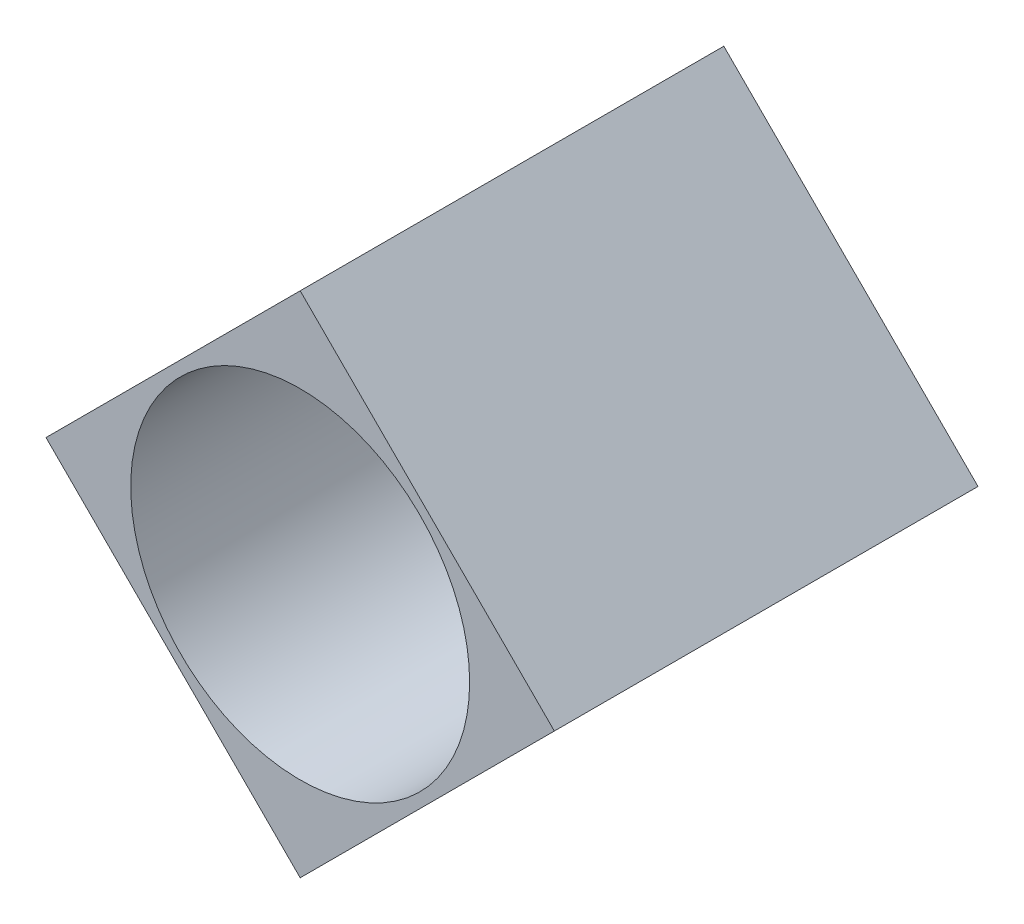
ISO-10303-21;
HEADER;
FILE_DESCRIPTION(('STEP AP214'),'2;1');
FILE_NAME('part.step','',(''),(''),'','','');
FILE_SCHEMA(('AUTOMOTIVE_DESIGN { 1 0 10303 214 1 1 1 1 }'));
ENDSEC;
DATA;
#1=APPLICATION_CONTEXT('core data for automotive mechanical design processes');
#2=APPLICATION_PROTOCOL_DEFINITION('international standard','automotive_design',2000,#1);
#3=PRODUCT_CONTEXT('',#1,'mechanical');
#4=PRODUCT('Part','Part','',(#3));
#5=PRODUCT_RELATED_PRODUCT_CATEGORY('part','',(#4));
#6=PRODUCT_DEFINITION_FORMATION('','',#4);
#7=PRODUCT_DEFINITION_CONTEXT('part definition',#1,'design');
#8=PRODUCT_DEFINITION('design','',#6,#7);
#9=PRODUCT_DEFINITION_SHAPE('','',#8);
#10=(LENGTH_UNIT() NAMED_UNIT(*) SI_UNIT(.MILLI.,.METRE.));
#11=(NAMED_UNIT(*) PLANE_ANGLE_UNIT() SI_UNIT($,.RADIAN.));
#12=(NAMED_UNIT(*) SI_UNIT($,.STERADIAN.) SOLID_ANGLE_UNIT());
#13=UNCERTAINTY_MEASURE_WITH_UNIT(LENGTH_MEASURE(1.E-05),#10,'distance_accuracy_value','');
#14=(GEOMETRIC_REPRESENTATION_CONTEXT(3) GLOBAL_UNCERTAINTY_ASSIGNED_CONTEXT((#13)) GLOBAL_UNIT_ASSIGNED_CONTEXT((#10,
#11,#12)) REPRESENTATION_CONTEXT('',''));
#15=CARTESIAN_POINT('',(0.,0.,0.));
#16=DIRECTION('',(0.,0.,1.));
#17=DIRECTION('',(1.,0.,0.));
#18=AXIS2_PLACEMENT_3D('',#15,#16,#17);
#19=CARTESIAN_POINT('',(0.,0.,5.));
#20=DIRECTION('',(0.,0.,-1.));
#21=DIRECTION('',(-1.,0.,0.));
#22=AXIS2_PLACEMENT_3D('',#19,#20,#21);
#23=PLANE('',#22);
#24=DIRECTION('',(-0.707106781186548,-0.707106781186548,0.));
#25=VECTOR('',#24,1.);
#26=CARTESIAN_POINT('',(-3.,0.,5.));
#27=LINE('',#26,#25);
#28=CARTESIAN_POINT('',(0.,3.,5.));
#29=VERTEX_POINT('',#28);
#30=CARTESIAN_POINT('',(-3.,0.,5.));
#31=VERTEX_POINT('',#30);
#32=EDGE_CURVE('E91',#29,#31,#27,.T.);
#33=ORIENTED_EDGE('',*,*,#32,.T.);
#34=DIRECTION('',(0.707106781186548,-0.707106781186548,0.));
#35=VECTOR('',#34,1.);
#36=CARTESIAN_POINT('',(0.,-3.,5.));
#37=LINE('',#36,#35);
#38=CARTESIAN_POINT('',(0.,-3.,5.));
#39=VERTEX_POINT('',#38);
#40=EDGE_CURVE('E86',#31,#39,#37,.T.);
#41=ORIENTED_EDGE('',*,*,#40,.T.);
#42=DIRECTION('',(0.707106781186548,0.707106781186548,0.));
#43=VECTOR('',#42,1.);
#44=CARTESIAN_POINT('',(3.,0.,5.));
#45=LINE('',#44,#43);
#46=CARTESIAN_POINT('',(3.,0.,5.));
#47=VERTEX_POINT('',#46);
#48=EDGE_CURVE('E89',#39,#47,#45,.T.);
#49=ORIENTED_EDGE('',*,*,#48,.T.);
#50=DIRECTION('',(-0.707106781186548,0.707106781186548,0.));
#51=VECTOR('',#50,1.);
#52=CARTESIAN_POINT('',(0.,3.,5.));
#53=LINE('',#52,#51);
#54=EDGE_CURVE('E56',#47,#29,#53,.T.);
#55=ORIENTED_EDGE('',*,*,#54,.T.);
#56=EDGE_LOOP('',(#33,#41,#49,#55));
#57=FACE_BOUND('',#56,.T.);
#58=CARTESIAN_POINT('',(0.,0.,5.));
#59=DIRECTION('',(0.,0.,1.));
#60=DIRECTION('',(1.,0.,0.));
#61=AXIS2_PLACEMENT_3D('',#58,#59,#60);
#62=CIRCLE('',#61,2.);
#63=CARTESIAN_POINT('',(2.,0.,5.));
#64=VERTEX_POINT('',#63);
#65=EDGE_CURVE('E106',#64,#64,#62,.T.);
#66=ORIENTED_EDGE('',*,*,#65,.F.);
#67=EDGE_LOOP('',(#66));
#68=FACE_BOUND('',#67,.T.);
#69=ADVANCED_FACE('F39',(#57,#68),#23,.F.);
#70=CARTESIAN_POINT('',(0.,0.,0.));
#71=DIRECTION('',(0.,0.,-1.));
#72=DIRECTION('',(-1.,0.,0.));
#73=AXIS2_PLACEMENT_3D('',#70,#71,#72);
#74=PLANE('',#73);
#75=DIRECTION('',(-0.707106781186548,-0.707106781186548,0.));
#76=VECTOR('',#75,1.);
#77=CARTESIAN_POINT('',(-3.,0.,0.));
#78=LINE('',#77,#76);
#79=CARTESIAN_POINT('',(0.,3.,0.));
#80=VERTEX_POINT('',#79);
#81=CARTESIAN_POINT('',(-3.,0.,0.));
#82=VERTEX_POINT('',#81);
#83=EDGE_CURVE('E103',#80,#82,#78,.T.);
#84=ORIENTED_EDGE('',*,*,#83,.F.);
#85=DIRECTION('',(-0.707106781186548,0.707106781186548,0.));
#86=VECTOR('',#85,1.);
#87=CARTESIAN_POINT('',(0.,3.,0.));
#88=LINE('',#87,#86);
#89=CARTESIAN_POINT('',(3.,0.,0.));
#90=VERTEX_POINT('',#89);
#91=EDGE_CURVE('E79',#90,#80,#88,.T.);
#92=ORIENTED_EDGE('',*,*,#91,.F.);
#93=DIRECTION('',(0.707106781186548,0.707106781186548,0.));
#94=VECTOR('',#93,1.);
#95=CARTESIAN_POINT('',(3.,0.,0.));
#96=LINE('',#95,#94);
#97=CARTESIAN_POINT('',(0.,-3.,0.));
#98=VERTEX_POINT('',#97);
#99=EDGE_CURVE('E73',#98,#90,#96,.T.);
#100=ORIENTED_EDGE('',*,*,#99,.F.);
#101=DIRECTION('',(0.707106781186548,-0.707106781186548,0.));
#102=VECTOR('',#101,1.);
#103=CARTESIAN_POINT('',(0.,-3.,0.));
#104=LINE('',#103,#102);
#105=EDGE_CURVE('E95',#82,#98,#104,.T.);
#106=ORIENTED_EDGE('',*,*,#105,.F.);
#107=EDGE_LOOP('',(#84,#92,#100,#106));
#108=FACE_BOUND('',#107,.T.);
#109=CARTESIAN_POINT('',(0.,0.,0.));
#110=DIRECTION('',(0.,0.,1.));
#111=DIRECTION('',(1.,0.,0.));
#112=AXIS2_PLACEMENT_3D('',#109,#110,#111);
#113=CIRCLE('',#112,2.);
#114=CARTESIAN_POINT('',(2.,0.,0.));
#115=VERTEX_POINT('',#114);
#116=EDGE_CURVE('E118',#115,#115,#113,.T.);
#117=ORIENTED_EDGE('',*,*,#116,.T.);
#118=EDGE_LOOP('',(#117));
#119=FACE_BOUND('',#118,.T.);
#120=ADVANCED_FACE('F114',(#108,#119),#74,.T.);
#121=CARTESIAN_POINT('',(-3.,0.,5.));
#122=DIRECTION('',(0.707106781186548,-0.707106781186548,0.));
#123=DIRECTION('',(0.707106781186548,0.707106781186548,0.));
#124=AXIS2_PLACEMENT_3D('',#121,#122,#123);
#125=PLANE('',#124);
#126=ORIENTED_EDGE('',*,*,#83,.T.);
#127=DIRECTION('',(0.,0.,-1.));
#128=VECTOR('',#127,1.);
#129=CARTESIAN_POINT('',(-3.,0.,5.));
#130=LINE('',#129,#128);
#131=EDGE_CURVE('E11',#31,#82,#130,.T.);
#132=ORIENTED_EDGE('',*,*,#131,.F.);
#133=ORIENTED_EDGE('',*,*,#32,.F.);
#134=DIRECTION('',(0.,0.,-1.));
#135=VECTOR('',#134,1.);
#136=CARTESIAN_POINT('',(0.,3.,5.));
#137=LINE('',#136,#135);
#138=EDGE_CURVE('E99',#29,#80,#137,.T.);
#139=ORIENTED_EDGE('',*,*,#138,.T.);
#140=EDGE_LOOP('',(#126,#132,#133,#139));
#141=FACE_BOUND('',#140,.T.);
#142=ADVANCED_FACE('F41',(#141),#125,.F.);
#143=CARTESIAN_POINT('',(0.,-3.,5.));
#144=DIRECTION('',(0.707106781186548,0.707106781186548,0.));
#145=DIRECTION('',(-0.707106781186548,0.707106781186548,0.));
#146=AXIS2_PLACEMENT_3D('',#143,#144,#145);
#147=PLANE('',#146);
#148=ORIENTED_EDGE('',*,*,#105,.T.);
#149=DIRECTION('',(0.,0.,-1.));
#150=VECTOR('',#149,1.);
#151=CARTESIAN_POINT('',(0.,-3.,5.));
#152=LINE('',#151,#150);
#153=EDGE_CURVE('E48',#39,#98,#152,.T.);
#154=ORIENTED_EDGE('',*,*,#153,.F.);
#155=ORIENTED_EDGE('',*,*,#40,.F.);
#156=ORIENTED_EDGE('',*,*,#131,.T.);
#157=EDGE_LOOP('',(#148,#154,#155,#156));
#158=FACE_BOUND('',#157,.T.);
#159=ADVANCED_FACE('F94',(#158),#147,.F.);
#160=CARTESIAN_POINT('',(3.,0.,5.));
#161=DIRECTION('',(-0.707106781186548,0.707106781186548,0.));
#162=DIRECTION('',(-0.707106781186548,-0.707106781186548,0.));
#163=AXIS2_PLACEMENT_3D('',#160,#161,#162);
#164=PLANE('',#163);
#165=ORIENTED_EDGE('',*,*,#99,.T.);
#166=DIRECTION('',(0.,0.,-1.));
#167=VECTOR('',#166,1.);
#168=CARTESIAN_POINT('',(3.,0.,5.));
#169=LINE('',#168,#167);
#170=EDGE_CURVE('E96',#47,#90,#169,.T.);
#171=ORIENTED_EDGE('',*,*,#170,.F.);
#172=ORIENTED_EDGE('',*,*,#48,.F.);
#173=ORIENTED_EDGE('',*,*,#153,.T.);
#174=EDGE_LOOP('',(#165,#171,#172,#173));
#175=FACE_BOUND('',#174,.T.);
#176=ADVANCED_FACE('F97',(#175),#164,.F.);
#177=CARTESIAN_POINT('',(0.,3.,5.));
#178=DIRECTION('',(-0.707106781186548,-0.707106781186548,0.));
#179=DIRECTION('',(0.707106781186548,-0.707106781186548,0.));
#180=AXIS2_PLACEMENT_3D('',#177,#178,#179);
#181=PLANE('',#180);
#182=ORIENTED_EDGE('',*,*,#91,.T.);
#183=ORIENTED_EDGE('',*,*,#138,.F.);
#184=ORIENTED_EDGE('',*,*,#54,.F.);
#185=ORIENTED_EDGE('',*,*,#170,.T.);
#186=EDGE_LOOP('',(#182,#183,#184,#185));
#187=FACE_BOUND('',#186,.T.);
#188=ADVANCED_FACE('F111',(#187),#181,.F.);
#189=CARTESIAN_POINT('',(0.,0.,5.));
#190=DIRECTION('',(0.,0.,-1.));
#191=DIRECTION('',(-1.,0.,0.));
#192=AXIS2_PLACEMENT_3D('',#189,#190,#191);
#193=CYLINDRICAL_SURFACE('',#192,2.);
#194=ORIENTED_EDGE('',*,*,#65,.T.);
#195=EDGE_LOOP('',(#194));
#196=FACE_BOUND('',#195,.T.);
#197=ORIENTED_EDGE('',*,*,#116,.F.);
#198=EDGE_LOOP('',(#197));
#199=FACE_BOUND('',#198,.T.);
#200=ADVANCED_FACE('F124',(#196,#199),#193,.F.);
#201=CLOSED_SHELL('',(#69,#120,#142,#159,#176,#188,#200));
#202=MANIFOLD_SOLID_BREP('B2',#201);
#203=ADVANCED_BREP_SHAPE_REPRESENTATION('',(#18,#202),#14);
#204=SHAPE_DEFINITION_REPRESENTATION(#9,#203);
ENDSEC;
END-ISO-10303-21;
